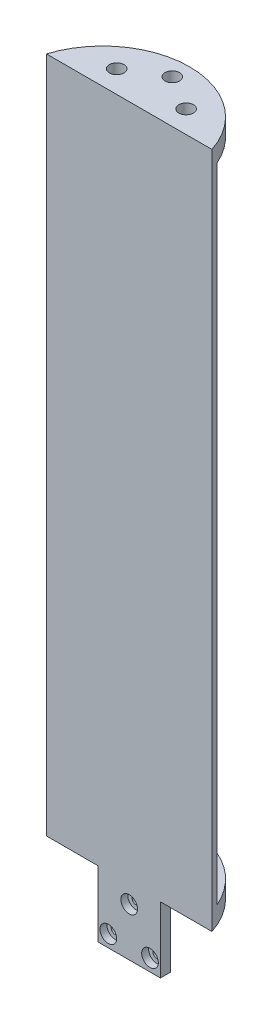
ISO-10303-21;
HEADER;
FILE_DESCRIPTION(('STEP AP214'),'2;1');
FILE_NAME('part.step','',(''),(''),'','','');
FILE_SCHEMA(('AUTOMOTIVE_DESIGN { 1 0 10303 214 1 1 1 1 }'));
ENDSEC;
DATA;
#1=APPLICATION_CONTEXT('core data for automotive mechanical design processes');
#2=APPLICATION_PROTOCOL_DEFINITION('international standard','automotive_design',2000,#1);
#3=PRODUCT_CONTEXT('',#1,'mechanical');
#4=PRODUCT('Part','Part','',(#3));
#5=PRODUCT_RELATED_PRODUCT_CATEGORY('part','',(#4));
#6=PRODUCT_DEFINITION_FORMATION('','',#4);
#7=PRODUCT_DEFINITION_CONTEXT('part definition',#1,'design');
#8=PRODUCT_DEFINITION('design','',#6,#7);
#9=PRODUCT_DEFINITION_SHAPE('','',#8);
#10=(LENGTH_UNIT() NAMED_UNIT(*) SI_UNIT(.MILLI.,.METRE.));
#11=(NAMED_UNIT(*) PLANE_ANGLE_UNIT() SI_UNIT($,.RADIAN.));
#12=(NAMED_UNIT(*) SI_UNIT($,.STERADIAN.) SOLID_ANGLE_UNIT());
#13=UNCERTAINTY_MEASURE_WITH_UNIT(LENGTH_MEASURE(1.E-05),#10,'distance_accuracy_value','');
#14=(GEOMETRIC_REPRESENTATION_CONTEXT(3) GLOBAL_UNCERTAINTY_ASSIGNED_CONTEXT((#13)) GLOBAL_UNIT_ASSIGNED_CONTEXT((#10,
#11,#12)) REPRESENTATION_CONTEXT('',''));
#15=CARTESIAN_POINT('',(0.,0.,0.));
#16=DIRECTION('',(0.,0.,1.));
#17=DIRECTION('',(1.,0.,0.));
#18=AXIS2_PLACEMENT_3D('',#15,#16,#17);
#19=CARTESIAN_POINT('',(30.2473370067515,117.475,-12.7));
#20=DIRECTION('',(0.,1.,0.));
#21=DIRECTION('',(0.,0.,1.));
#22=AXIS2_PLACEMENT_3D('',#19,#20,#21);
#23=PLANE('',#22);
#24=DIRECTION('',(1.,0.,0.));
#25=VECTOR('',#24,1.);
#26=CARTESIAN_POINT('',(30.2473370067515,117.475,-12.7));
#27=LINE('',#26,#25);
#28=CARTESIAN_POINT('',(5.715,117.475,-12.7));
#29=VERTEX_POINT('',#28);
#30=CARTESIAN_POINT('',(29.0993556629696,117.475,-12.7));
#31=VERTEX_POINT('',#30);
#32=EDGE_CURVE('E178',#29,#31,#27,.T.);
#33=ORIENTED_EDGE('',*,*,#32,.F.);
#34=DIRECTION('',(0.,0.,1.));
#35=VECTOR('',#34,1.);
#36=CARTESIAN_POINT('',(5.715,117.475,-31.5908511281352));
#37=LINE('',#36,#35);
#38=CARTESIAN_POINT('',(5.715,117.475,-31.2314148734892));
#39=VERTEX_POINT('',#38);
#40=EDGE_CURVE('E57',#29,#39,#37,.F.);
#41=ORIENTED_EDGE('',*,*,#40,.T.);
#42=CARTESIAN_POINT('',(0.,117.475,0.));
#43=DIRECTION('',(0.,1.,0.));
#44=DIRECTION('',(0.,0.,1.));
#45=AXIS2_PLACEMENT_3D('',#42,#43,#44);
#46=CIRCLE('',#45,31.75);
#47=EDGE_CURVE('E162',#31,#39,#46,.T.);
#48=ORIENTED_EDGE('',*,*,#47,.F.);
#49=EDGE_LOOP('',(#33,#41,#48));
#50=FACE_BOUND('',#49,.T.);
#51=ADVANCED_FACE('F39',(#50),#23,.F.);
#52=CARTESIAN_POINT('',(30.2473370067515,-117.475,-12.7));
#53=DIRECTION('',(0.,-1.,0.));
#54=DIRECTION('',(0.,0.,-1.));
#55=AXIS2_PLACEMENT_3D('',#52,#53,#54);
#56=PLANE('',#55);
#57=CARTESIAN_POINT('',(0.,-117.475,0.));
#58=DIRECTION('',(0.,-1.,0.));
#59=DIRECTION('',(0.,0.,-1.));
#60=AXIS2_PLACEMENT_3D('',#57,#58,#59);
#61=CIRCLE('',#60,31.75);
#62=CARTESIAN_POINT('',(5.715,-117.475,-31.2314148734892));
#63=VERTEX_POINT('',#62);
#64=CARTESIAN_POINT('',(29.0993556629696,-117.475,-12.7));
#65=VERTEX_POINT('',#64);
#66=EDGE_CURVE('E279',#63,#65,#61,.T.);
#67=ORIENTED_EDGE('',*,*,#66,.F.);
#68=DIRECTION('',(0.,0.,1.));
#69=VECTOR('',#68,1.);
#70=CARTESIAN_POINT('',(5.715,-117.475,-12.7));
#71=LINE('',#70,#69);
#72=CARTESIAN_POINT('',(5.715,-117.475,-12.7));
#73=VERTEX_POINT('',#72);
#74=EDGE_CURVE('E307',#63,#73,#71,.T.);
#75=ORIENTED_EDGE('',*,*,#74,.T.);
#76=DIRECTION('',(-1.,0.,0.));
#77=VECTOR('',#76,1.);
#78=CARTESIAN_POINT('',(30.2473370067515,-117.475,-12.7));
#79=LINE('',#78,#77);
#80=EDGE_CURVE('E183',#65,#73,#79,.T.);
#81=ORIENTED_EDGE('',*,*,#80,.F.);
#82=EDGE_LOOP('',(#67,#75,#81));
#83=FACE_BOUND('',#82,.T.);
#84=ADVANCED_FACE('F374',(#83),#56,.F.);
#85=CARTESIAN_POINT('',(0.,0.,-12.7));
#86=DIRECTION('',(0.,0.,-1.));
#87=DIRECTION('',(-1.,0.,0.));
#88=AXIS2_PLACEMENT_3D('',#85,#86,#87);
#89=PLANE('',#88);
#90=ORIENTED_EDGE('',*,*,#80,.T.);
#91=DIRECTION('',(0.,1.,0.));
#92=VECTOR('',#91,1.);
#93=CARTESIAN_POINT('',(5.715,0.,-12.7));
#94=LINE('',#93,#92);
#95=EDGE_CURVE('E287',#73,#29,#94,.T.);
#96=ORIENTED_EDGE('',*,*,#95,.T.);
#97=ORIENTED_EDGE('',*,*,#32,.T.);
#98=DIRECTION('',(0.,-1.,0.));
#99=VECTOR('',#98,1.);
#100=CARTESIAN_POINT('',(29.0993556629696,123.825,-12.7));
#101=LINE('',#100,#99);
#102=EDGE_CURVE('E173',#31,#65,#101,.T.);
#103=ORIENTED_EDGE('',*,*,#102,.T.);
#104=EDGE_LOOP('',(#90,#96,#97,#103));
#105=FACE_BOUND('',#104,.T.);
#106=ADVANCED_FACE('F330',(#105),#89,.T.);
#107=CARTESIAN_POINT('',(0.,123.825,0.));
#108=DIRECTION('',(0.,-1.,0.));
#109=DIRECTION('',(0.,0.,-1.));
#110=AXIS2_PLACEMENT_3D('',#107,#108,#109);
#111=CYLINDRICAL_SURFACE('',#110,31.75);
#112=ORIENTED_EDGE('',*,*,#47,.T.);
#113=CARTESIAN_POINT('',(5.715,117.475,-31.2314148734892));
#114=CARTESIAN_POINT('',(5.6435020396598,117.475006444057,-31.2445006282859));
#115=CARTESIAN_POINT('',(5.57195935122281,117.471981066791,-31.2573360180113));
#116=CARTESIAN_POINT('',(5.42928232649377,117.459892726637,-31.2824327818969));
#117=CARTESIAN_POINT('',(5.35814800363206,117.450829566314,-31.294694137272));
#118=CARTESIAN_POINT('',(5.21680571763799,117.426694359572,-31.318566070835));
#119=CARTESIAN_POINT('',(5.14659755531139,117.411623627743,-31.3301767907627));
#120=CARTESIAN_POINT('',(5.00762341729917,117.375569461079,-31.3526900584708));
#121=CARTESIAN_POINT('',(4.93885739256495,117.354586227686,-31.3635926303626));
#122=CARTESIAN_POINT('',(4.735348107055,117.282878016263,-31.3951866436664));
#123=CARTESIAN_POINT('',(4.60339389034031,117.223394570614,-31.4147643398226));
#124=CARTESIAN_POINT('',(4.35127760752344,117.082724091974,-31.450678142163));
#125=CARTESIAN_POINT('',(4.23111094721428,117.001545560969,-31.4670155138229));
#126=CARTESIAN_POINT('',(4.00726460845834,116.820660905865,-31.4963005471533));
#127=CARTESIAN_POINT('',(3.90342438230464,116.721159261338,-31.5092821485777));
#128=CARTESIAN_POINT('',(3.71384500829651,116.505846145402,-31.5321899713364));
#129=CARTESIAN_POINT('',(3.62810965992717,116.390031258984,-31.5421155515347));
#130=CARTESIAN_POINT('',(3.47798377529607,116.146470812717,-31.5590210162522));
#131=CARTESIAN_POINT('',(3.41342127364675,116.018832749721,-31.5660247653522));
#132=CARTESIAN_POINT('',(3.30660704970203,115.754471440662,-31.5773930967286));
#133=CARTESIAN_POINT('',(3.26434066293167,115.617754232882,-31.5817594139567));
#134=CARTESIAN_POINT('',(3.21428042187341,115.389278252553,-31.5868846688374));
#135=CARTESIAN_POINT('',(3.19955875247655,115.298993343979,-31.5883758643423));
#136=CARTESIAN_POINT('',(3.17992036829521,115.117485237461,-31.5903566834558));
#137=CARTESIAN_POINT('',(3.1749894714064,115.026263589351,-31.5908477557868));
#138=CARTESIAN_POINT('',(3.175,114.935,-31.5908511281352));
#139=B_SPLINE_CURVE_WITH_KNOTS('',3,(#113,#114,#115,#116,#117,#118,#119,#120,#121,#122,#123,
#124,#125,#126,#127,#128,#129,#130,#131,#132,#133,#134,#135,#136,#137,#138),.UNSPECIFIED.,.F.,
.F.,(4,2,2,2,2,2,2,2,2,2,2,2,4),(0.,0.21799071390249,0.435988556485608,0.653938722527584,
0.871881463797872,1.30776772414058,1.74348341686804,2.17460278068074,2.60581252937885,
3.03342787191974,3.46076161393332,3.73473322514493,4.00830769335698),.UNSPECIFIED.);
#140=CARTESIAN_POINT('',(3.17499999999998,114.935,-31.5908511281352));
#141=VERTEX_POINT('',#140);
#142=EDGE_CURVE('E11',#39,#141,#139,.T.);
#143=ORIENTED_EDGE('',*,*,#142,.T.);
#144=DIRECTION('',(0.,1.,0.));
#145=VECTOR('',#144,1.);
#146=CARTESIAN_POINT('',(3.17499999999998,-137.555463142069,-31.5908511281352));
#147=LINE('',#146,#145);
#148=CARTESIAN_POINT('',(3.17499999999998,-114.935,-31.5908511281352));
#149=VERTEX_POINT('',#148);
#150=EDGE_CURVE('E816',#149,#141,#147,.T.);
#151=ORIENTED_EDGE('',*,*,#150,.F.);
#152=CARTESIAN_POINT('',(3.175,-114.935,-31.5908511281352));
#153=CARTESIAN_POINT('',(3.17499298196918,-115.006114862048,-31.590850043116));
#154=CARTESIAN_POINT('',(3.1779865759197,-115.077226471163,-31.5905509191962));
#155=CARTESIAN_POINT('',(3.1899207844466,-115.218940290423,-31.58934901629));
#156=CARTESIAN_POINT('',(3.19886109841815,-115.289542526135,-31.5884462678165));
#157=CARTESIAN_POINT('',(3.22262481531264,-115.429684564349,-31.5860305299507));
#158=CARTESIAN_POINT('',(3.23744339234613,-115.49922518989,-31.5845180411216));
#159=CARTESIAN_POINT('',(3.2728399011216,-115.636787261587,-31.5808697233855));
#160=CARTESIAN_POINT('',(3.29341776421057,-115.704808725841,-31.5787339019087));
#161=CARTESIAN_POINT('',(3.36361669875521,-115.905936750077,-31.5713609677305));
#162=CARTESIAN_POINT('',(3.4217131145938,-116.036165554419,-31.565157419235));
#163=CARTESIAN_POINT('',(3.55870693439019,-116.284882843776,-31.5500050692735));
#164=CARTESIAN_POINT('',(3.63760093802163,-116.403373243623,-31.5410567165335));
#165=CARTESIAN_POINT('',(3.81397102816577,-116.625504780884,-31.5202156715319));
#166=CARTESIAN_POINT('',(3.91146335293543,-116.729132802359,-31.5083204035779));
#167=CARTESIAN_POINT('',(4.122125284492,-116.918537095556,-31.4814522075178));
#168=CARTESIAN_POINT('',(4.23529731093353,-117.00431060689,-31.4664788042282));
#169=CARTESIAN_POINT('',(4.47451250189984,-117.156023387467,-31.433355958432));
#170=CARTESIAN_POINT('',(4.60061026869378,-117.221873447541,-31.4151927901489));
#171=CARTESIAN_POINT('',(4.86159942298442,-117.331522896393,-31.3758622084013));
#172=CARTESIAN_POINT('',(4.99648781188021,-117.375329760395,-31.3546958165069));
#173=CARTESIAN_POINT('',(5.22921325740386,-117.430042544144,-31.3165641654061));
#174=CARTESIAN_POINT('',(5.32580835799836,-117.446907382545,-31.3002855282036));
#175=CARTESIAN_POINT('',(5.51995440180166,-117.469385001283,-31.2666340846262));
#176=CARTESIAN_POINT('',(5.61750362117434,-117.475015272833,-31.2492630226286));
#177=CARTESIAN_POINT('',(5.715,-117.475,-31.2314148734892));
#178=B_SPLINE_CURVE_WITH_KNOTS('',3,(#152,#153,#154,#155,#156,#157,#158,#159,#160,#161,#162,
#163,#164,#165,#166,#167,#168,#169,#170,#171,#172,#173,#174,#175,#176,#177),.UNSPECIFIED.,.F.,
.F.,(4,2,2,2,2,2,2,2,2,2,2,2,4),(0.,0.213275112384225,0.426539444597418,0.639629053918463,
0.85271612323364,1.27871410718894,1.7046424852478,2.13094445907163,2.55731229223813,
2.98556189901456,3.41366618099937,3.71124959639209,4.00836933850066),.UNSPECIFIED.);
#179=EDGE_CURVE('E318',#149,#63,#178,.T.);
#180=ORIENTED_EDGE('',*,*,#179,.T.);
#181=ORIENTED_EDGE('',*,*,#66,.T.);
#182=ORIENTED_EDGE('',*,*,#102,.F.);
#183=EDGE_LOOP('',(#112,#143,#151,#180,#181,#182));
#184=FACE_BOUND('',#183,.T.);
#185=CARTESIAN_POINT('',(0.,-123.825,0.));
#186=DIRECTION('',(0.,1.,0.));
#187=DIRECTION('',(0.,0.,1.));
#188=AXIS2_PLACEMENT_3D('',#185,#186,#187);
#189=CIRCLE('',#188,31.75);
#190=CARTESIAN_POINT('',(30.2473370067515,-123.825,-9.652));
#191=VERTEX_POINT('',#190);
#192=CARTESIAN_POINT('',(-30.2473370067515,-123.825,-9.652));
#193=VERTEX_POINT('',#192);
#194=EDGE_CURVE('E267',#191,#193,#189,.T.);
#195=ORIENTED_EDGE('',*,*,#194,.T.);
#196=DIRECTION('',(0.,-1.,0.));
#197=VECTOR('',#196,1.);
#198=CARTESIAN_POINT('',(-30.2473370067515,123.825,-9.652));
#199=LINE('',#198,#197);
#200=CARTESIAN_POINT('',(-30.2473370067515,123.825,-9.652));
#201=VERTEX_POINT('',#200);
#202=EDGE_CURVE('E269',#201,#193,#199,.T.);
#203=ORIENTED_EDGE('',*,*,#202,.F.);
#204=CARTESIAN_POINT('',(0.,123.825,0.));
#205=DIRECTION('',(0.,1.,0.));
#206=DIRECTION('',(0.,0.,1.));
#207=AXIS2_PLACEMENT_3D('',#204,#205,#206);
#208=CIRCLE('',#207,31.75);
#209=CARTESIAN_POINT('',(30.2473370067515,123.825,-9.652));
#210=VERTEX_POINT('',#209);
#211=EDGE_CURVE('E266',#210,#201,#208,.T.);
#212=ORIENTED_EDGE('',*,*,#211,.F.);
#213=DIRECTION('',(0.,-1.,0.));
#214=VECTOR('',#213,1.);
#215=CARTESIAN_POINT('',(30.2473370067515,123.825,-9.652));
#216=LINE('',#215,#214);
#217=EDGE_CURVE('E276',#210,#191,#216,.T.);
#218=ORIENTED_EDGE('',*,*,#217,.T.);
#219=EDGE_LOOP('',(#195,#203,#212,#218));
#220=FACE_BOUND('',#219,.T.);
#221=CARTESIAN_POINT('',(-29.0993556629696,-117.475,-12.7));
#222=VERTEX_POINT('',#221);
#223=CARTESIAN_POINT('',(-5.715,-117.475,-31.2314148734892));
#224=VERTEX_POINT('',#223);
#225=EDGE_CURVE('E163',#222,#224,#61,.T.);
#226=ORIENTED_EDGE('',*,*,#225,.T.);
#227=CARTESIAN_POINT('',(-5.715,-117.475,-31.2314148734892));
#228=CARTESIAN_POINT('',(-5.6435020396598,-117.475006444057,-31.2445006282859));
#229=CARTESIAN_POINT('',(-5.57195935122281,-117.47198106679,-31.2573360180113));
#230=CARTESIAN_POINT('',(-5.42928232649377,-117.459892726637,-31.2824327818969));
#231=CARTESIAN_POINT('',(-5.35814800363206,-117.450829566314,-31.294694137272));
#232=CARTESIAN_POINT('',(-5.21680571763799,-117.426694359572,-31.318566070835));
#233=CARTESIAN_POINT('',(-5.14659755531139,-117.411623627743,-31.3301767907627));
#234=CARTESIAN_POINT('',(-5.00762341729917,-117.375569461079,-31.3526900584708));
#235=CARTESIAN_POINT('',(-4.93885739256495,-117.354586227686,-31.3635926303626));
#236=CARTESIAN_POINT('',(-4.73534810705499,-117.282878016263,-31.3951866436664));
#237=CARTESIAN_POINT('',(-4.60339389034031,-117.223394570614,-31.4147643398226));
#238=CARTESIAN_POINT('',(-4.35127760752344,-117.082724091974,-31.450678142163));
#239=CARTESIAN_POINT('',(-4.23111094721428,-117.001545560969,-31.4670155138229));
#240=CARTESIAN_POINT('',(-4.00726460845835,-116.820660905865,-31.4963005471533));
#241=CARTESIAN_POINT('',(-3.90342438230465,-116.721159261338,-31.5092821485777));
#242=CARTESIAN_POINT('',(-3.71384500829652,-116.505846145402,-31.5321899713364));
#243=CARTESIAN_POINT('',(-3.62810965992717,-116.390031258984,-31.5421155515347));
#244=CARTESIAN_POINT('',(-3.47798377529607,-116.146470812717,-31.5590210162522));
#245=CARTESIAN_POINT('',(-3.41342127364675,-116.018832749721,-31.5660247653522));
#246=CARTESIAN_POINT('',(-3.30660704970203,-115.754471440662,-31.5773930967286));
#247=CARTESIAN_POINT('',(-3.26434066293167,-115.617754232882,-31.5817594139567));
#248=CARTESIAN_POINT('',(-3.21428042187342,-115.389278252553,-31.5868846688374));
#249=CARTESIAN_POINT('',(-3.19955875247655,-115.298993343979,-31.5883758643423));
#250=CARTESIAN_POINT('',(-3.17992036829521,-115.11748523746,-31.5903566834558));
#251=CARTESIAN_POINT('',(-3.1749894714064,-115.026263589351,-31.5908477557868));
#252=CARTESIAN_POINT('',(-3.175,-114.935,-31.5908511281352));
#253=B_SPLINE_CURVE_WITH_KNOTS('',3,(#227,#228,#229,#230,#231,#232,#233,#234,#235,#236,#237,
#238,#239,#240,#241,#242,#243,#244,#245,#246,#247,#248,#249,#250,#251,#252),.UNSPECIFIED.,.F.,
.F.,(4,2,2,2,2,2,2,2,2,2,2,2,4),(0.,0.217990713902489,0.435988556485606,0.653938722527587,
0.871881463797873,1.30776772414058,1.74348341686804,2.17460278068073,2.60581252937885,
3.03342787191974,3.46076161393332,3.73473322514491,4.00830769335698),.UNSPECIFIED.);
#254=CARTESIAN_POINT('',(-3.17499999999998,-114.935,-31.5908511281352));
#255=VERTEX_POINT('',#254);
#256=EDGE_CURVE('E311',#224,#255,#253,.T.);
#257=ORIENTED_EDGE('',*,*,#256,.T.);
#258=DIRECTION('',(0.,1.,0.));
#259=VECTOR('',#258,1.);
#260=CARTESIAN_POINT('',(-3.17499999999998,-137.555463142069,-31.5908511281352));
#261=LINE('',#260,#259);
#262=CARTESIAN_POINT('',(-3.17499999999998,114.935,-31.5908511281352));
#263=VERTEX_POINT('',#262);
#264=EDGE_CURVE('E819',#255,#263,#261,.T.);
#265=ORIENTED_EDGE('',*,*,#264,.T.);
#266=CARTESIAN_POINT('',(-3.175,114.935,-31.5908511281352));
#267=CARTESIAN_POINT('',(-3.17499298196918,115.006114862048,-31.590850043116));
#268=CARTESIAN_POINT('',(-3.1779865759197,115.077226471163,-31.5905509191962));
#269=CARTESIAN_POINT('',(-3.1899207844466,115.218940290423,-31.58934901629));
#270=CARTESIAN_POINT('',(-3.19886109841815,115.289542526135,-31.5884462678165));
#271=CARTESIAN_POINT('',(-3.22262481531264,115.429684564349,-31.5860305299507));
#272=CARTESIAN_POINT('',(-3.23744339234613,115.49922518989,-31.5845180411216));
#273=CARTESIAN_POINT('',(-3.2728399011216,115.636787261587,-31.5808697233855));
#274=CARTESIAN_POINT('',(-3.29341776421057,115.704808725841,-31.5787339019087));
#275=CARTESIAN_POINT('',(-3.36361669875521,115.905936750077,-31.5713609677305));
#276=CARTESIAN_POINT('',(-3.42171311459381,116.036165554419,-31.565157419235));
#277=CARTESIAN_POINT('',(-3.55870693439019,116.284882843776,-31.5500050692735));
#278=CARTESIAN_POINT('',(-3.63760093802163,116.403373243623,-31.5410567165335));
#279=CARTESIAN_POINT('',(-3.81397102816578,116.625504780884,-31.5202156715319));
#280=CARTESIAN_POINT('',(-3.91146335293544,116.729132802359,-31.5083204035779));
#281=CARTESIAN_POINT('',(-4.12212528449201,116.918537095556,-31.4814522075178));
#282=CARTESIAN_POINT('',(-4.23529731093354,117.00431060689,-31.4664788042282));
#283=CARTESIAN_POINT('',(-4.47451250189985,117.156023387467,-31.433355958432));
#284=CARTESIAN_POINT('',(-4.60061026869378,117.221873447541,-31.4151927901489));
#285=CARTESIAN_POINT('',(-4.86159942298442,117.331522896393,-31.3758622084013));
#286=CARTESIAN_POINT('',(-4.99648781188022,117.375329760395,-31.3546958165069));
#287=CARTESIAN_POINT('',(-5.22921325740386,117.430042544144,-31.3165641654061));
#288=CARTESIAN_POINT('',(-5.32580835799836,117.446907382545,-31.3002855282036));
#289=CARTESIAN_POINT('',(-5.51995440180166,117.469385001283,-31.2666340846262));
#290=CARTESIAN_POINT('',(-5.61750362117434,117.475015272833,-31.2492630226286));
#291=CARTESIAN_POINT('',(-5.71500000000001,117.475,-31.2314148734892));
#292=B_SPLINE_CURVE_WITH_KNOTS('',3,(#266,#267,#268,#269,#270,#271,#272,#273,#274,#275,#276,
#277,#278,#279,#280,#281,#282,#283,#284,#285,#286,#287,#288,#289,#290,#291),.UNSPECIFIED.,.F.,
.F.,(4,2,2,2,2,2,2,2,2,2,2,2,4),(0.,0.213275112384225,0.426539444597418,0.639629053918463,
0.85271612323364,1.27871410718894,1.7046424852478,2.13094445907165,2.55731229223813,
2.98556189901456,3.41366618099937,3.71124959639209,4.00836933850066),.UNSPECIFIED.);
#293=CARTESIAN_POINT('',(-5.71500000000001,117.475,-31.2314148734892));
#294=VERTEX_POINT('',#293);
#295=EDGE_CURVE('E49',#263,#294,#292,.T.);
#296=ORIENTED_EDGE('',*,*,#295,.T.);
#297=CARTESIAN_POINT('',(-29.0993556629696,117.475,-12.7));
#298=VERTEX_POINT('',#297);
#299=EDGE_CURVE('E154',#294,#298,#46,.T.);
#300=ORIENTED_EDGE('',*,*,#299,.T.);
#301=DIRECTION('',(0.,-1.,0.));
#302=VECTOR('',#301,1.);
#303=CARTESIAN_POINT('',(-29.0993556629696,123.825,-12.7));
#304=LINE('',#303,#302);
#305=EDGE_CURVE('E158',#222,#298,#304,.F.);
#306=ORIENTED_EDGE('',*,*,#305,.F.);
#307=EDGE_LOOP('',(#226,#257,#265,#296,#300,#306));
#308=FACE_BOUND('',#307,.T.);
#309=ADVANCED_FACE('F157',(#184,#220,#308),#111,.T.);
#310=CARTESIAN_POINT('',(0.,123.825,-9.652));
#311=DIRECTION('',(0.,0.,-1.));
#312=DIRECTION('',(-1.,0.,0.));
#313=AXIS2_PLACEMENT_3D('',#310,#311,#312);
#314=PLANE('',#313);
#315=CARTESIAN_POINT('',(0.,-130.316247377827,-9.652));
#316=DIRECTION('',(0.,0.,1.));
#317=DIRECTION('',(1.,0.,0.));
#318=AXIS2_PLACEMENT_3D('',#315,#316,#317);
#319=CIRCLE('',#318,3.048);
#320=CARTESIAN_POINT('',(3.04799999999999,-130.316247377827,-9.652));
#321=VERTEX_POINT('',#320);
#322=EDGE_CURVE('E202',#321,#321,#319,.T.);
#323=ORIENTED_EDGE('',*,*,#322,.F.);
#324=EDGE_LOOP('',(#323));
#325=FACE_BOUND('',#324,.T.);
#326=CARTESIAN_POINT('',(-7.62000000000001,-143.514474531502,-9.652));
#327=DIRECTION('',(0.,0.,1.));
#328=DIRECTION('',(1.,0.,0.));
#329=AXIS2_PLACEMENT_3D('',#326,#327,#328);
#330=CIRCLE('',#329,3.048);
#331=CARTESIAN_POINT('',(-4.57200000000001,-143.514474531502,-9.652));
#332=VERTEX_POINT('',#331);
#333=EDGE_CURVE('E205',#332,#332,#330,.T.);
#334=ORIENTED_EDGE('',*,*,#333,.F.);
#335=EDGE_LOOP('',(#334));
#336=FACE_BOUND('',#335,.T.);
#337=CARTESIAN_POINT('',(7.61999999999999,-143.514474531502,-9.652));
#338=DIRECTION('',(0.,0.,1.));
#339=DIRECTION('',(1.,0.,0.));
#340=AXIS2_PLACEMENT_3D('',#337,#338,#339);
#341=CIRCLE('',#340,3.048);
#342=CARTESIAN_POINT('',(10.668,-143.514474531502,-9.652));
#343=VERTEX_POINT('',#342);
#344=EDGE_CURVE('E211',#343,#343,#341,.T.);
#345=ORIENTED_EDGE('',*,*,#344,.F.);
#346=EDGE_LOOP('',(#345));
#347=FACE_BOUND('',#346,.T.);
#348=DIRECTION('',(1.,0.,0.));
#349=VECTOR('',#348,1.);
#350=CARTESIAN_POINT('',(0.,-123.825,-9.652));
#351=LINE('',#350,#349);
#352=CARTESIAN_POINT('',(-11.43,-123.825,-9.652));
#353=VERTEX_POINT('',#352);
#354=EDGE_CURVE('E270',#193,#353,#351,.T.);
#355=ORIENTED_EDGE('',*,*,#354,.T.);
#356=DIRECTION('',(0.,1.,0.));
#357=VECTOR('',#356,1.);
#358=CARTESIAN_POINT('',(-11.43,-147.955,-9.652));
#359=LINE('',#358,#357);
#360=CARTESIAN_POINT('',(-11.43,-147.955,-9.652));
#361=VERTEX_POINT('',#360);
#362=EDGE_CURVE('E256',#361,#353,#359,.T.);
#363=ORIENTED_EDGE('',*,*,#362,.F.);
#364=DIRECTION('',(-1.,0.,0.));
#365=VECTOR('',#364,1.);
#366=CARTESIAN_POINT('',(0.,-147.955,-9.652));
#367=LINE('',#366,#365);
#368=CARTESIAN_POINT('',(11.43,-147.955,-9.652));
#369=VERTEX_POINT('',#368);
#370=EDGE_CURVE('E237',#369,#361,#367,.T.);
#371=ORIENTED_EDGE('',*,*,#370,.F.);
#372=DIRECTION('',(0.,1.,0.));
#373=VECTOR('',#372,1.);
#374=CARTESIAN_POINT('',(11.43,-147.955,-9.652));
#375=LINE('',#374,#373);
#376=CARTESIAN_POINT('',(11.43,-123.825,-9.652));
#377=VERTEX_POINT('',#376);
#378=EDGE_CURVE('E259',#369,#377,#375,.T.);
#379=ORIENTED_EDGE('',*,*,#378,.T.);
#380=EDGE_CURVE('E262',#377,#191,#351,.T.);
#381=ORIENTED_EDGE('',*,*,#380,.T.);
#382=ORIENTED_EDGE('',*,*,#217,.F.);
#383=DIRECTION('',(1.,0.,0.));
#384=VECTOR('',#383,1.);
#385=CARTESIAN_POINT('',(0.,123.825,-9.652));
#386=LINE('',#385,#384);
#387=EDGE_CURVE('E263',#201,#210,#386,.T.);
#388=ORIENTED_EDGE('',*,*,#387,.F.);
#389=ORIENTED_EDGE('',*,*,#202,.T.);
#390=EDGE_LOOP('',(#355,#363,#371,#379,#381,#382,#388,#389));
#391=FACE_BOUND('',#390,.T.);
#392=ADVANCED_FACE('F329',(#325,#336,#347,#391),#314,.F.);
#393=CARTESIAN_POINT('',(0.,123.825,0.));
#394=DIRECTION('',(0.,1.,0.));
#395=DIRECTION('',(0.,0.,1.));
#396=AXIS2_PLACEMENT_3D('',#393,#394,#395);
#397=PLANE('',#396);
#398=CARTESIAN_POINT('',(0.,123.825,-25.4));
#399=DIRECTION('',(0.,1.,0.));
#400=DIRECTION('',(0.,0.,1.));
#401=AXIS2_PLACEMENT_3D('',#398,#399,#400);
#402=CIRCLE('',#401,2.667);
#403=CARTESIAN_POINT('',(0.,123.825,-22.733));
#404=VERTEX_POINT('',#403);
#405=EDGE_CURVE('E220',#404,#404,#402,.T.);
#406=ORIENTED_EDGE('',*,*,#405,.F.);
#407=EDGE_LOOP('',(#406));
#408=FACE_BOUND('',#407,.T.);
#409=CARTESIAN_POINT('',(-12.7,123.825,-17.78));
#410=DIRECTION('',(0.,1.,0.));
#411=DIRECTION('',(0.,0.,1.));
#412=AXIS2_PLACEMENT_3D('',#409,#410,#411);
#413=CIRCLE('',#412,2.667);
#414=CARTESIAN_POINT('',(-12.7,123.825,-15.113));
#415=VERTEX_POINT('',#414);
#416=EDGE_CURVE('E226',#415,#415,#413,.T.);
#417=ORIENTED_EDGE('',*,*,#416,.F.);
#418=EDGE_LOOP('',(#417));
#419=FACE_BOUND('',#418,.T.);
#420=CARTESIAN_POINT('',(12.7,123.825,-17.78));
#421=DIRECTION('',(0.,1.,0.));
#422=DIRECTION('',(0.,0.,1.));
#423=AXIS2_PLACEMENT_3D('',#420,#421,#422);
#424=CIRCLE('',#423,2.667);
#425=CARTESIAN_POINT('',(12.7,123.825,-15.113));
#426=VERTEX_POINT('',#425);
#427=EDGE_CURVE('E201',#426,#426,#424,.T.);
#428=ORIENTED_EDGE('',*,*,#427,.F.);
#429=EDGE_LOOP('',(#428));
#430=FACE_BOUND('',#429,.T.);
#431=ORIENTED_EDGE('',*,*,#387,.T.);
#432=ORIENTED_EDGE('',*,*,#211,.T.);
#433=EDGE_LOOP('',(#431,#432));
#434=FACE_BOUND('',#433,.T.);
#435=ADVANCED_FACE('F467',(#408,#419,#430,#434),#397,.T.);
#436=CARTESIAN_POINT('',(0.,-123.825,0.));
#437=DIRECTION('',(0.,1.,0.));
#438=DIRECTION('',(0.,0.,1.));
#439=AXIS2_PLACEMENT_3D('',#436,#437,#438);
#440=PLANE('',#439);
#441=ORIENTED_EDGE('',*,*,#380,.F.);
#442=DIRECTION('',(0.,0.,-1.));
#443=VECTOR('',#442,1.);
#444=CARTESIAN_POINT('',(11.43,-123.825,0.));
#445=LINE('',#444,#443);
#446=CARTESIAN_POINT('',(11.43,-123.825,-13.335));
#447=VERTEX_POINT('',#446);
#448=EDGE_CURVE('E219',#377,#447,#445,.T.);
#449=ORIENTED_EDGE('',*,*,#448,.T.);
#450=DIRECTION('',(1.,0.,0.));
#451=VECTOR('',#450,1.);
#452=CARTESIAN_POINT('',(0.,-123.825,-13.335));
#453=LINE('',#452,#451);
#454=CARTESIAN_POINT('',(-11.43,-123.825,-13.335));
#455=VERTEX_POINT('',#454);
#456=EDGE_CURVE('E238',#455,#447,#453,.T.);
#457=ORIENTED_EDGE('',*,*,#456,.F.);
#458=DIRECTION('',(0.,0.,-1.));
#459=VECTOR('',#458,1.);
#460=CARTESIAN_POINT('',(-11.43,-123.825,0.));
#461=LINE('',#460,#459);
#462=EDGE_CURVE('E246',#353,#455,#461,.T.);
#463=ORIENTED_EDGE('',*,*,#462,.F.);
#464=ORIENTED_EDGE('',*,*,#354,.F.);
#465=ORIENTED_EDGE('',*,*,#194,.F.);
#466=EDGE_LOOP('',(#441,#449,#457,#463,#464,#465));
#467=FACE_BOUND('',#466,.T.);
#468=ADVANCED_FACE('F332',(#467),#440,.F.);
#469=CARTESIAN_POINT('',(11.43,-147.955,0.));
#470=DIRECTION('',(1.,0.,0.));
#471=DIRECTION('',(0.,0.,-1.));
#472=AXIS2_PLACEMENT_3D('',#469,#470,#471);
#473=PLANE('',#472);
#474=ORIENTED_EDGE('',*,*,#448,.F.);
#475=ORIENTED_EDGE('',*,*,#378,.F.);
#476=DIRECTION('',(0.,0.,-1.));
#477=VECTOR('',#476,1.);
#478=CARTESIAN_POINT('',(11.43,-147.955,0.));
#479=LINE('',#478,#477);
#480=CARTESIAN_POINT('',(11.43,-147.955,-13.335));
#481=VERTEX_POINT('',#480);
#482=EDGE_CURVE('E234',#369,#481,#479,.T.);
#483=ORIENTED_EDGE('',*,*,#482,.T.);
#484=DIRECTION('',(0.,1.,0.));
#485=VECTOR('',#484,1.);
#486=CARTESIAN_POINT('',(11.43,-147.955,-13.335));
#487=LINE('',#486,#485);
#488=EDGE_CURVE('E244',#481,#447,#487,.T.);
#489=ORIENTED_EDGE('',*,*,#488,.T.);
#490=EDGE_LOOP('',(#474,#475,#483,#489));
#491=FACE_BOUND('',#490,.T.);
#492=ADVANCED_FACE('F463',(#491),#473,.T.);
#493=CARTESIAN_POINT('',(-11.43,-147.955,0.));
#494=DIRECTION('',(1.,0.,0.));
#495=DIRECTION('',(0.,0.,-1.));
#496=AXIS2_PLACEMENT_3D('',#493,#494,#495);
#497=PLANE('',#496);
#498=ORIENTED_EDGE('',*,*,#462,.T.);
#499=DIRECTION('',(0.,1.,0.));
#500=VECTOR('',#499,1.);
#501=CARTESIAN_POINT('',(-11.43,-147.955,-13.335));
#502=LINE('',#501,#500);
#503=CARTESIAN_POINT('',(-11.43,-147.955,-13.335));
#504=VERTEX_POINT('',#503);
#505=EDGE_CURVE('E253',#504,#455,#502,.T.);
#506=ORIENTED_EDGE('',*,*,#505,.F.);
#507=DIRECTION('',(0.,0.,-1.));
#508=VECTOR('',#507,1.);
#509=CARTESIAN_POINT('',(-11.43,-147.955,0.));
#510=LINE('',#509,#508);
#511=EDGE_CURVE('E240',#361,#504,#510,.T.);
#512=ORIENTED_EDGE('',*,*,#511,.F.);
#513=ORIENTED_EDGE('',*,*,#362,.T.);
#514=EDGE_LOOP('',(#498,#506,#512,#513));
#515=FACE_BOUND('',#514,.T.);
#516=ADVANCED_FACE('F459',(#515),#497,.F.);
#517=CARTESIAN_POINT('',(0.,-147.955,-13.335));
#518=DIRECTION('',(0.,0.,1.));
#519=DIRECTION('',(1.,0.,0.));
#520=AXIS2_PLACEMENT_3D('',#517,#518,#519);
#521=PLANE('',#520);
#522=CARTESIAN_POINT('',(0.,-130.316247377827,-13.335));
#523=DIRECTION('',(0.,0.,1.));
#524=DIRECTION('',(1.,0.,0.));
#525=AXIS2_PLACEMENT_3D('',#522,#523,#524);
#526=CIRCLE('',#525,1.49999999999999);
#527=CARTESIAN_POINT('',(1.49999999999998,-130.316247377827,-13.335));
#528=VERTEX_POINT('',#527);
#529=EDGE_CURVE('E177',#528,#528,#526,.T.);
#530=ORIENTED_EDGE('',*,*,#529,.T.);
#531=EDGE_LOOP('',(#530));
#532=FACE_BOUND('',#531,.T.);
#533=CARTESIAN_POINT('',(7.61999999999999,-143.514474531502,-13.335));
#534=DIRECTION('',(0.,0.,1.));
#535=DIRECTION('',(1.,0.,0.));
#536=AXIS2_PLACEMENT_3D('',#533,#534,#535);
#537=CIRCLE('',#536,1.49999999999999);
#538=CARTESIAN_POINT('',(9.11999999999998,-143.514474531502,-13.335));
#539=VERTEX_POINT('',#538);
#540=EDGE_CURVE('E189',#539,#539,#537,.T.);
#541=ORIENTED_EDGE('',*,*,#540,.T.);
#542=EDGE_LOOP('',(#541));
#543=FACE_BOUND('',#542,.T.);
#544=CARTESIAN_POINT('',(-7.62000000000001,-143.514474531502,-13.335));
#545=DIRECTION('',(0.,0.,1.));
#546=DIRECTION('',(1.,0.,0.));
#547=AXIS2_PLACEMENT_3D('',#544,#545,#546);
#548=CIRCLE('',#547,1.49999999999999);
#549=CARTESIAN_POINT('',(-6.12000000000002,-143.514474531502,-13.335));
#550=VERTEX_POINT('',#549);
#551=EDGE_CURVE('E194',#550,#550,#548,.T.);
#552=ORIENTED_EDGE('',*,*,#551,.T.);
#553=EDGE_LOOP('',(#552));
#554=FACE_BOUND('',#553,.T.);
#555=ORIENTED_EDGE('',*,*,#456,.T.);
#556=ORIENTED_EDGE('',*,*,#488,.F.);
#557=DIRECTION('',(1.,0.,0.));
#558=VECTOR('',#557,1.);
#559=CARTESIAN_POINT('',(0.,-147.955,-13.335));
#560=LINE('',#559,#558);
#561=EDGE_CURVE('E242',#504,#481,#560,.T.);
#562=ORIENTED_EDGE('',*,*,#561,.F.);
#563=ORIENTED_EDGE('',*,*,#505,.T.);
#564=EDGE_LOOP('',(#555,#556,#562,#563));
#565=FACE_BOUND('',#564,.T.);
#566=ADVANCED_FACE('F455',(#532,#543,#554,#565),#521,.F.);
#567=CARTESIAN_POINT('',(0.,-147.955,0.));
#568=DIRECTION('',(0.,-1.,0.));
#569=DIRECTION('',(0.,0.,-1.));
#570=AXIS2_PLACEMENT_3D('',#567,#568,#569);
#571=PLANE('',#570);
#572=ORIENTED_EDGE('',*,*,#482,.F.);
#573=ORIENTED_EDGE('',*,*,#370,.T.);
#574=ORIENTED_EDGE('',*,*,#511,.T.);
#575=ORIENTED_EDGE('',*,*,#561,.T.);
#576=EDGE_LOOP('',(#572,#573,#574,#575));
#577=FACE_BOUND('',#576,.T.);
#578=ADVANCED_FACE('F451',(#577),#571,.T.);
#579=CARTESIAN_POINT('',(12.7,118.745,-17.78));
#580=DIRECTION('',(0.,1.,0.));
#581=DIRECTION('',(0.,0.,1.));
#582=AXIS2_PLACEMENT_3D('',#579,#580,#581);
#583=CYLINDRICAL_SURFACE('',#582,2.667);
#584=CARTESIAN_POINT('',(12.7,118.745,-17.78));
#585=DIRECTION('',(0.,1.,0.));
#586=DIRECTION('',(0.,0.,1.));
#587=AXIS2_PLACEMENT_3D('',#584,#585,#586);
#588=CIRCLE('',#587,2.667);
#589=CARTESIAN_POINT('',(12.7,118.745,-15.113));
#590=VERTEX_POINT('',#589);
#591=EDGE_CURVE('E229',#590,#590,#588,.T.);
#592=ORIENTED_EDGE('',*,*,#591,.F.);
#593=EDGE_LOOP('',(#592));
#594=FACE_BOUND('',#593,.T.);
#595=ORIENTED_EDGE('',*,*,#427,.T.);
#596=EDGE_LOOP('',(#595));
#597=FACE_BOUND('',#596,.T.);
#598=ADVANCED_FACE('F447',(#594,#597),#583,.F.);
#599=CARTESIAN_POINT('',(0.,118.745,0.));
#600=DIRECTION('',(0.,1.,0.));
#601=DIRECTION('',(0.,0.,1.));
#602=AXIS2_PLACEMENT_3D('',#599,#600,#601);
#603=PLANE('',#602);
#604=ORIENTED_EDGE('',*,*,#591,.T.);
#605=EDGE_LOOP('',(#604));
#606=FACE_BOUND('',#605,.T.);
#607=ADVANCED_FACE('F443',(#606),#603,.T.);
#608=CARTESIAN_POINT('',(-12.7,118.745,-17.78));
#609=DIRECTION('',(0.,1.,0.));
#610=DIRECTION('',(0.,0.,1.));
#611=AXIS2_PLACEMENT_3D('',#608,#609,#610);
#612=CYLINDRICAL_SURFACE('',#611,2.667);
#613=CARTESIAN_POINT('',(-12.7,118.745,-17.78));
#614=DIRECTION('',(0.,1.,0.));
#615=DIRECTION('',(0.,0.,1.));
#616=AXIS2_PLACEMENT_3D('',#613,#614,#615);
#617=CIRCLE('',#616,2.667);
#618=CARTESIAN_POINT('',(-12.7,118.745,-15.113));
#619=VERTEX_POINT('',#618);
#620=EDGE_CURVE('E223',#619,#619,#617,.T.);
#621=ORIENTED_EDGE('',*,*,#620,.F.);
#622=EDGE_LOOP('',(#621));
#623=FACE_BOUND('',#622,.T.);
#624=ORIENTED_EDGE('',*,*,#416,.T.);
#625=EDGE_LOOP('',(#624));
#626=FACE_BOUND('',#625,.T.);
#627=ADVANCED_FACE('F439',(#623,#626),#612,.F.);
#628=CARTESIAN_POINT('',(0.,118.745,0.));
#629=DIRECTION('',(0.,1.,0.));
#630=DIRECTION('',(0.,0.,1.));
#631=AXIS2_PLACEMENT_3D('',#628,#629,#630);
#632=PLANE('',#631);
#633=ORIENTED_EDGE('',*,*,#620,.T.);
#634=EDGE_LOOP('',(#633));
#635=FACE_BOUND('',#634,.T.);
#636=ADVANCED_FACE('F435',(#635),#632,.T.);
#637=CARTESIAN_POINT('',(0.,118.745,-25.4));
#638=DIRECTION('',(0.,1.,0.));
#639=DIRECTION('',(0.,0.,1.));
#640=AXIS2_PLACEMENT_3D('',#637,#638,#639);
#641=CYLINDRICAL_SURFACE('',#640,2.667);
#642=CARTESIAN_POINT('',(0.,118.745,-25.4));
#643=DIRECTION('',(0.,1.,0.));
#644=DIRECTION('',(0.,0.,1.));
#645=AXIS2_PLACEMENT_3D('',#642,#643,#644);
#646=CIRCLE('',#645,2.667);
#647=CARTESIAN_POINT('',(0.,118.745,-22.733));
#648=VERTEX_POINT('',#647);
#649=EDGE_CURVE('E216',#648,#648,#646,.T.);
#650=ORIENTED_EDGE('',*,*,#649,.F.);
#651=EDGE_LOOP('',(#650));
#652=FACE_BOUND('',#651,.T.);
#653=ORIENTED_EDGE('',*,*,#405,.T.);
#654=EDGE_LOOP('',(#653));
#655=FACE_BOUND('',#654,.T.);
#656=ADVANCED_FACE('F431',(#652,#655),#641,.F.);
#657=CARTESIAN_POINT('',(0.,118.745,0.));
#658=DIRECTION('',(0.,1.,0.));
#659=DIRECTION('',(0.,0.,1.));
#660=AXIS2_PLACEMENT_3D('',#657,#658,#659);
#661=PLANE('',#660);
#662=ORIENTED_EDGE('',*,*,#649,.T.);
#663=EDGE_LOOP('',(#662));
#664=FACE_BOUND('',#663,.T.);
#665=ADVANCED_FACE('F424',(#664),#661,.T.);
#666=CARTESIAN_POINT('',(7.61999999999999,-143.514474531502,-12.192));
#667=DIRECTION('',(0.,0.,1.));
#668=DIRECTION('',(1.,0.,0.));
#669=AXIS2_PLACEMENT_3D('',#666,#667,#668);
#670=CYLINDRICAL_SURFACE('',#669,3.048);
#671=CARTESIAN_POINT('',(7.61999999999999,-143.514474531502,-12.192));
#672=DIRECTION('',(0.,0.,1.));
#673=DIRECTION('',(1.,0.,0.));
#674=AXIS2_PLACEMENT_3D('',#671,#672,#673);
#675=CIRCLE('',#674,3.048);
#676=CARTESIAN_POINT('',(10.668,-143.514474531502,-12.192));
#677=VERTEX_POINT('',#676);
#678=EDGE_CURVE('E197',#677,#677,#675,.T.);
#679=ORIENTED_EDGE('',*,*,#678,.F.);
#680=EDGE_LOOP('',(#679));
#681=FACE_BOUND('',#680,.T.);
#682=ORIENTED_EDGE('',*,*,#344,.T.);
#683=EDGE_LOOP('',(#682));
#684=FACE_BOUND('',#683,.T.);
#685=ADVANCED_FACE('F421',(#681,#684),#670,.F.);
#686=CARTESIAN_POINT('',(7.61999999999999,-143.514474531502,-12.192));
#687=DIRECTION('',(0.,0.,1.));
#688=DIRECTION('',(1.,0.,0.));
#689=AXIS2_PLACEMENT_3D('',#686,#687,#688);
#690=PLANE('',#689);
#691=CARTESIAN_POINT('',(7.61999999999999,-143.514474531502,-12.192));
#692=DIRECTION('',(0.,0.,1.));
#693=DIRECTION('',(1.,0.,0.));
#694=AXIS2_PLACEMENT_3D('',#691,#692,#693);
#695=CIRCLE('',#694,1.49999999999999);
#696=CARTESIAN_POINT('',(9.11999999999998,-143.514474531502,-12.192));
#697=VERTEX_POINT('',#696);
#698=EDGE_CURVE('E190',#697,#697,#695,.T.);
#699=ORIENTED_EDGE('',*,*,#698,.F.);
#700=EDGE_LOOP('',(#699));
#701=FACE_BOUND('',#700,.T.);
#702=ORIENTED_EDGE('',*,*,#678,.T.);
#703=EDGE_LOOP('',(#702));
#704=FACE_BOUND('',#703,.T.);
#705=ADVANCED_FACE('F416',(#701,#704),#690,.T.);
#706=CARTESIAN_POINT('',(-7.62000000000001,-143.514474531502,-12.192));
#707=DIRECTION('',(0.,0.,1.));
#708=DIRECTION('',(1.,0.,0.));
#709=AXIS2_PLACEMENT_3D('',#706,#707,#708);
#710=CYLINDRICAL_SURFACE('',#709,3.048);
#711=CARTESIAN_POINT('',(-7.62000000000001,-143.514474531502,-12.192));
#712=DIRECTION('',(0.,0.,1.));
#713=DIRECTION('',(1.,0.,0.));
#714=AXIS2_PLACEMENT_3D('',#711,#712,#713);
#715=CIRCLE('',#714,3.048);
#716=CARTESIAN_POINT('',(-4.57200000000001,-143.514474531502,-12.192));
#717=VERTEX_POINT('',#716);
#718=EDGE_CURVE('E208',#717,#717,#715,.T.);
#719=ORIENTED_EDGE('',*,*,#718,.F.);
#720=EDGE_LOOP('',(#719));
#721=FACE_BOUND('',#720,.T.);
#722=ORIENTED_EDGE('',*,*,#333,.T.);
#723=EDGE_LOOP('',(#722));
#724=FACE_BOUND('',#723,.T.);
#725=ADVANCED_FACE('F413',(#721,#724),#710,.F.);
#726=CARTESIAN_POINT('',(-7.62000000000001,-143.514474531502,-12.192));
#727=DIRECTION('',(0.,0.,1.));
#728=DIRECTION('',(1.,0.,0.));
#729=AXIS2_PLACEMENT_3D('',#726,#727,#728);
#730=PLANE('',#729);
#731=CARTESIAN_POINT('',(-7.62000000000001,-143.514474531502,-12.192));
#732=DIRECTION('',(0.,0.,1.));
#733=DIRECTION('',(1.,0.,0.));
#734=AXIS2_PLACEMENT_3D('',#731,#732,#733);
#735=CIRCLE('',#734,1.49999999999999);
#736=CARTESIAN_POINT('',(-6.12000000000002,-143.514474531502,-12.192));
#737=VERTEX_POINT('',#736);
#738=EDGE_CURVE('E193',#737,#737,#735,.T.);
#739=ORIENTED_EDGE('',*,*,#738,.F.);
#740=EDGE_LOOP('',(#739));
#741=FACE_BOUND('',#740,.T.);
#742=ORIENTED_EDGE('',*,*,#718,.T.);
#743=EDGE_LOOP('',(#742));
#744=FACE_BOUND('',#743,.T.);
#745=ADVANCED_FACE('F411',(#741,#744),#730,.T.);
#746=CARTESIAN_POINT('',(0.,-130.316247377827,-12.192));
#747=DIRECTION('',(0.,0.,1.));
#748=DIRECTION('',(1.,0.,0.));
#749=AXIS2_PLACEMENT_3D('',#746,#747,#748);
#750=CYLINDRICAL_SURFACE('',#749,3.048);
#751=CARTESIAN_POINT('',(0.,-130.316247377827,-12.192));
#752=DIRECTION('',(0.,0.,1.));
#753=DIRECTION('',(1.,0.,0.));
#754=AXIS2_PLACEMENT_3D('',#751,#752,#753);
#755=CIRCLE('',#754,3.048);
#756=CARTESIAN_POINT('',(3.04799999999999,-130.316247377827,-12.192));
#757=VERTEX_POINT('',#756);
#758=EDGE_CURVE('E198',#757,#757,#755,.T.);
#759=ORIENTED_EDGE('',*,*,#758,.F.);
#760=EDGE_LOOP('',(#759));
#761=FACE_BOUND('',#760,.T.);
#762=ORIENTED_EDGE('',*,*,#322,.T.);
#763=EDGE_LOOP('',(#762));
#764=FACE_BOUND('',#763,.T.);
#765=ADVANCED_FACE('F407',(#761,#764),#750,.F.);
#766=CARTESIAN_POINT('',(0.,-130.316247377827,-12.192));
#767=DIRECTION('',(0.,0.,1.));
#768=DIRECTION('',(1.,0.,0.));
#769=AXIS2_PLACEMENT_3D('',#766,#767,#768);
#770=PLANE('',#769);
#771=CARTESIAN_POINT('',(0.,-130.316247377827,-12.192));
#772=DIRECTION('',(0.,0.,1.));
#773=DIRECTION('',(1.,0.,0.));
#774=AXIS2_PLACEMENT_3D('',#771,#772,#773);
#775=CIRCLE('',#774,1.49999999999999);
#776=CARTESIAN_POINT('',(1.49999999999998,-130.316247377827,-12.192));
#777=VERTEX_POINT('',#776);
#778=EDGE_CURVE('E181',#777,#777,#775,.T.);
#779=ORIENTED_EDGE('',*,*,#778,.F.);
#780=EDGE_LOOP('',(#779));
#781=FACE_BOUND('',#780,.T.);
#782=ORIENTED_EDGE('',*,*,#758,.T.);
#783=EDGE_LOOP('',(#782));
#784=FACE_BOUND('',#783,.T.);
#785=ADVANCED_FACE('F403',(#781,#784),#770,.T.);
#786=CARTESIAN_POINT('',(-7.62000000000001,-143.514474531502,-9.652));
#787=DIRECTION('',(0.,0.,1.));
#788=DIRECTION('',(1.,0.,0.));
#789=AXIS2_PLACEMENT_3D('',#786,#787,#788);
#790=CYLINDRICAL_SURFACE('',#789,1.49999999999999);
#791=ORIENTED_EDGE('',*,*,#738,.T.);
#792=EDGE_LOOP('',(#791));
#793=FACE_BOUND('',#792,.T.);
#794=ORIENTED_EDGE('',*,*,#551,.F.);
#795=EDGE_LOOP('',(#794));
#796=FACE_BOUND('',#795,.T.);
#797=ADVANCED_FACE('F396',(#793,#796),#790,.F.);
#798=CARTESIAN_POINT('',(7.61999999999999,-143.514474531502,-9.652));
#799=DIRECTION('',(0.,0.,1.));
#800=DIRECTION('',(1.,0.,0.));
#801=AXIS2_PLACEMENT_3D('',#798,#799,#800);
#802=CYLINDRICAL_SURFACE('',#801,1.49999999999999);
#803=ORIENTED_EDGE('',*,*,#698,.T.);
#804=EDGE_LOOP('',(#803));
#805=FACE_BOUND('',#804,.T.);
#806=ORIENTED_EDGE('',*,*,#540,.F.);
#807=EDGE_LOOP('',(#806));
#808=FACE_BOUND('',#807,.T.);
#809=ADVANCED_FACE('F390',(#805,#808),#802,.F.);
#810=CARTESIAN_POINT('',(0.,-130.316247377827,-9.652));
#811=DIRECTION('',(0.,0.,1.));
#812=DIRECTION('',(1.,0.,0.));
#813=AXIS2_PLACEMENT_3D('',#810,#811,#812);
#814=CYLINDRICAL_SURFACE('',#813,1.49999999999999);
#815=ORIENTED_EDGE('',*,*,#778,.T.);
#816=EDGE_LOOP('',(#815));
#817=FACE_BOUND('',#816,.T.);
#818=ORIENTED_EDGE('',*,*,#529,.F.);
#819=EDGE_LOOP('',(#818));
#820=FACE_BOUND('',#819,.T.);
#821=ADVANCED_FACE('F384',(#817,#820),#814,.F.);
#822=ORIENTED_EDGE('',*,*,#299,.F.);
#823=DIRECTION('',(0.,0.,1.));
#824=VECTOR('',#823,1.);
#825=CARTESIAN_POINT('',(-5.71500000000001,117.475,-12.7));
#826=LINE('',#825,#824);
#827=CARTESIAN_POINT('',(-5.71500000000001,117.475,-12.7));
#828=VERTEX_POINT('',#827);
#829=EDGE_CURVE('E176',#294,#828,#826,.T.);
#830=ORIENTED_EDGE('',*,*,#829,.T.);
#831=EDGE_CURVE('E168',#298,#828,#27,.T.);
#832=ORIENTED_EDGE('',*,*,#831,.F.);
#833=EDGE_LOOP('',(#822,#830,#832));
#834=FACE_BOUND('',#833,.T.);
#835=ADVANCED_FACE('F175',(#834),#23,.F.);
#836=CARTESIAN_POINT('',(-5.71500000000001,-117.475,-12.7));
#837=VERTEX_POINT('',#836);
#838=EDGE_CURVE('E171',#837,#222,#79,.T.);
#839=ORIENTED_EDGE('',*,*,#838,.F.);
#840=DIRECTION('',(0.,0.,1.));
#841=VECTOR('',#840,1.);
#842=CARTESIAN_POINT('',(-5.71500000000001,-117.475,-12.7));
#843=LINE('',#842,#841);
#844=EDGE_CURVE('E305',#837,#224,#843,.F.);
#845=ORIENTED_EDGE('',*,*,#844,.T.);
#846=ORIENTED_EDGE('',*,*,#225,.F.);
#847=EDGE_LOOP('',(#839,#845,#846));
#848=FACE_BOUND('',#847,.T.);
#849=ADVANCED_FACE('F381',(#848),#56,.F.);
#850=ORIENTED_EDGE('',*,*,#831,.T.);
#851=DIRECTION('',(0.,1.,0.));
#852=VECTOR('',#851,1.);
#853=CARTESIAN_POINT('',(-5.715,-117.475,-12.7));
#854=LINE('',#853,#852);
#855=EDGE_CURVE('E303',#828,#837,#854,.F.);
#856=ORIENTED_EDGE('',*,*,#855,.T.);
#857=ORIENTED_EDGE('',*,*,#838,.T.);
#858=ORIENTED_EDGE('',*,*,#305,.T.);
#859=EDGE_LOOP('',(#850,#856,#857,#858));
#860=FACE_BOUND('',#859,.T.);
#861=ADVANCED_FACE('F167',(#860),#89,.T.);
#862=CARTESIAN_POINT('',(-3.175,-137.555463142069,0.));
#863=DIRECTION('',(-1.,0.,0.));
#864=DIRECTION('',(0.,0.,1.));
#865=AXIS2_PLACEMENT_3D('',#862,#863,#864);
#866=PLANE('',#865);
#867=ORIENTED_EDGE('',*,*,#264,.F.);
#868=DIRECTION('',(0.,0.,1.));
#869=VECTOR('',#868,1.);
#870=CARTESIAN_POINT('',(-3.175,-114.935,0.));
#871=LINE('',#870,#869);
#872=CARTESIAN_POINT('',(-3.175,-114.935,-15.24));
#873=VERTEX_POINT('',#872);
#874=EDGE_CURVE('E301',#255,#873,#871,.T.);
#875=ORIENTED_EDGE('',*,*,#874,.T.);
#876=DIRECTION('',(0.,1.,0.));
#877=VECTOR('',#876,1.);
#878=CARTESIAN_POINT('',(-3.175,117.475,-15.24));
#879=LINE('',#878,#877);
#880=CARTESIAN_POINT('',(-3.175,114.935,-15.24));
#881=VERTEX_POINT('',#880);
#882=EDGE_CURVE('E298',#873,#881,#879,.T.);
#883=ORIENTED_EDGE('',*,*,#882,.T.);
#884=DIRECTION('',(0.,0.,1.));
#885=VECTOR('',#884,1.);
#886=CARTESIAN_POINT('',(-3.175,114.935,0.));
#887=LINE('',#886,#885);
#888=EDGE_CURVE('E296',#881,#263,#887,.F.);
#889=ORIENTED_EDGE('',*,*,#888,.T.);
#890=EDGE_LOOP('',(#867,#875,#883,#889));
#891=FACE_BOUND('',#890,.T.);
#892=ADVANCED_FACE('F724',(#891),#866,.T.);
#893=CARTESIAN_POINT('',(3.175,-137.555463142069,0.));
#894=DIRECTION('',(-1.,0.,0.));
#895=DIRECTION('',(0.,0.,1.));
#896=AXIS2_PLACEMENT_3D('',#893,#894,#895);
#897=PLANE('',#896);
#898=DIRECTION('',(0.,1.,0.));
#899=VECTOR('',#898,1.);
#900=CARTESIAN_POINT('',(3.175,-137.555463142069,-15.24));
#901=LINE('',#900,#899);
#902=CARTESIAN_POINT('',(3.175,114.935,-15.24));
#903=VERTEX_POINT('',#902);
#904=CARTESIAN_POINT('',(3.175,-114.935,-15.24));
#905=VERTEX_POINT('',#904);
#906=EDGE_CURVE('E292',#903,#905,#901,.F.);
#907=ORIENTED_EDGE('',*,*,#906,.T.);
#908=DIRECTION('',(0.,0.,1.));
#909=VECTOR('',#908,1.);
#910=CARTESIAN_POINT('',(3.175,-114.935,-31.5908511281352));
#911=LINE('',#910,#909);
#912=EDGE_CURVE('E294',#905,#149,#911,.F.);
#913=ORIENTED_EDGE('',*,*,#912,.T.);
#914=ORIENTED_EDGE('',*,*,#150,.T.);
#915=DIRECTION('',(0.,0.,1.));
#916=VECTOR('',#915,1.);
#917=CARTESIAN_POINT('',(3.175,114.935,-12.7));
#918=LINE('',#917,#916);
#919=EDGE_CURVE('E290',#141,#903,#918,.T.);
#920=ORIENTED_EDGE('',*,*,#919,.T.);
#921=EDGE_LOOP('',(#907,#913,#914,#920));
#922=FACE_BOUND('',#921,.T.);
#923=ADVANCED_FACE('F360',(#922),#897,.F.);
#924=CARTESIAN_POINT('',(5.715,-114.935,-12.7));
#925=DIRECTION('',(0.,0.,-1.));
#926=DIRECTION('',(-1.,0.,0.));
#927=AXIS2_PLACEMENT_3D('',#924,#925,#926);
#928=CYLINDRICAL_SURFACE('',#927,2.54);
#929=ORIENTED_EDGE('',*,*,#179,.F.);
#930=ORIENTED_EDGE('',*,*,#912,.F.);
#931=CARTESIAN_POINT('',(5.715,-114.935,-15.24));
#932=DIRECTION('',(0.,0.707106781186547,0.707106781186547));
#933=DIRECTION('',(0.,0.707106781186547,-0.707106781186547));
#934=AXIS2_PLACEMENT_3D('',#931,#932,#933);
#935=ELLIPSE('',#934,3.59210244842766,2.54);
#936=EDGE_CURVE('E814',#73,#905,#935,.F.);
#937=ORIENTED_EDGE('',*,*,#936,.F.);
#938=ORIENTED_EDGE('',*,*,#74,.F.);
#939=EDGE_LOOP('',(#929,#930,#937,#938));
#940=FACE_BOUND('',#939,.T.);
#941=ADVANCED_FACE('F356',(#940),#928,.F.);
#942=CARTESIAN_POINT('',(5.715,114.935,0.));
#943=DIRECTION('',(0.,0.,-1.));
#944=DIRECTION('',(-1.,0.,0.));
#945=AXIS2_PLACEMENT_3D('',#942,#943,#944);
#946=CYLINDRICAL_SURFACE('',#945,2.54);
#947=ORIENTED_EDGE('',*,*,#142,.F.);
#948=ORIENTED_EDGE('',*,*,#40,.F.);
#949=CARTESIAN_POINT('',(5.715,114.935,-15.24));
#950=DIRECTION('',(0.,0.707106781186547,-0.707106781186547));
#951=DIRECTION('',(0.,0.707106781186547,0.707106781186547));
#952=AXIS2_PLACEMENT_3D('',#949,#950,#951);
#953=ELLIPSE('',#952,3.59210244842766,2.54);
#954=EDGE_CURVE('E817',#903,#29,#953,.T.);
#955=ORIENTED_EDGE('',*,*,#954,.F.);
#956=ORIENTED_EDGE('',*,*,#919,.F.);
#957=EDGE_LOOP('',(#947,#948,#955,#956));
#958=FACE_BOUND('',#957,.T.);
#959=ADVANCED_FACE('F359',(#958),#946,.F.);
#960=CARTESIAN_POINT('',(5.715,0.,-15.24));
#961=DIRECTION('',(0.,1.,0.));
#962=DIRECTION('',(0.,0.,1.));
#963=AXIS2_PLACEMENT_3D('',#960,#961,#962);
#964=CYLINDRICAL_SURFACE('',#963,2.54);
#965=ORIENTED_EDGE('',*,*,#936,.T.);
#966=ORIENTED_EDGE('',*,*,#906,.F.);
#967=ORIENTED_EDGE('',*,*,#954,.T.);
#968=ORIENTED_EDGE('',*,*,#95,.F.);
#969=EDGE_LOOP('',(#965,#966,#967,#968));
#970=FACE_BOUND('',#969,.T.);
#971=ADVANCED_FACE('F364',(#970),#964,.F.);
#972=CARTESIAN_POINT('',(-5.715,-114.935,0.));
#973=DIRECTION('',(0.,0.,1.));
#974=DIRECTION('',(1.,0.,0.));
#975=AXIS2_PLACEMENT_3D('',#972,#973,#974);
#976=CYLINDRICAL_SURFACE('',#975,2.54);
#977=ORIENTED_EDGE('',*,*,#256,.F.);
#978=ORIENTED_EDGE('',*,*,#844,.F.);
#979=CARTESIAN_POINT('',(-5.715,-114.935,-15.24));
#980=DIRECTION('',(0.,-0.707106781186547,-0.707106781186547));
#981=DIRECTION('',(0.,-0.707106781186547,0.707106781186547));
#982=AXIS2_PLACEMENT_3D('',#979,#980,#981);
#983=ELLIPSE('',#982,3.59210244842766,2.54);
#984=EDGE_CURVE('E44',#873,#837,#983,.T.);
#985=ORIENTED_EDGE('',*,*,#984,.F.);
#986=ORIENTED_EDGE('',*,*,#874,.F.);
#987=EDGE_LOOP('',(#977,#978,#985,#986));
#988=FACE_BOUND('',#987,.T.);
#989=ADVANCED_FACE('F41',(#988),#976,.F.);
#990=CARTESIAN_POINT('',(-5.71500000000001,114.935,-12.7));
#991=DIRECTION('',(0.,0.,1.));
#992=DIRECTION('',(1.,0.,0.));
#993=AXIS2_PLACEMENT_3D('',#990,#991,#992);
#994=CYLINDRICAL_SURFACE('',#993,2.54);
#995=ORIENTED_EDGE('',*,*,#295,.F.);
#996=ORIENTED_EDGE('',*,*,#888,.F.);
#997=CARTESIAN_POINT('',(-5.715,114.935,-15.24));
#998=DIRECTION('',(0.,-0.707106781186547,0.707106781186547));
#999=DIRECTION('',(0.,-0.707106781186547,-0.707106781186547));
#1000=AXIS2_PLACEMENT_3D('',#997,#998,#999);
#1001=ELLIPSE('',#1000,3.59210244842766,2.54);
#1002=EDGE_CURVE('E821',#828,#881,#1001,.F.);
#1003=ORIENTED_EDGE('',*,*,#1002,.F.);
#1004=ORIENTED_EDGE('',*,*,#829,.F.);
#1005=EDGE_LOOP('',(#995,#996,#1003,#1004));
#1006=FACE_BOUND('',#1005,.T.);
#1007=ADVANCED_FACE('F348',(#1006),#994,.F.);
#1008=CARTESIAN_POINT('',(-5.715,-137.555463142069,-15.24));
#1009=DIRECTION('',(0.,-1.,0.));
#1010=DIRECTION('',(0.,0.,-1.));
#1011=AXIS2_PLACEMENT_3D('',#1008,#1009,#1010);
#1012=CYLINDRICAL_SURFACE('',#1011,2.54);
#1013=ORIENTED_EDGE('',*,*,#984,.T.);
#1014=ORIENTED_EDGE('',*,*,#855,.F.);
#1015=ORIENTED_EDGE('',*,*,#1002,.T.);
#1016=ORIENTED_EDGE('',*,*,#882,.F.);
#1017=EDGE_LOOP('',(#1013,#1014,#1015,#1016));
#1018=FACE_BOUND('',#1017,.T.);
#1019=ADVANCED_FACE('F352',(#1018),#1012,.F.);
#1020=CLOSED_SHELL('',(#51,#84,#106,#309,#392,#435,#468,#492,#516,#566,#578,#598,#607,#627,#636,
#656,#665,#685,#705,#725,#745,#765,#785,#797,#809,#821,#835,#849,#861,#892,#923,#941,#959,#971,
#989,#1007,#1019));
#1021=MANIFOLD_SOLID_BREP('B2',#1020);
#1022=ADVANCED_BREP_SHAPE_REPRESENTATION('',(#18,#1021),#14);
#1023=SHAPE_DEFINITION_REPRESENTATION(#9,#1022);
ENDSEC;
END-ISO-10303-21;
